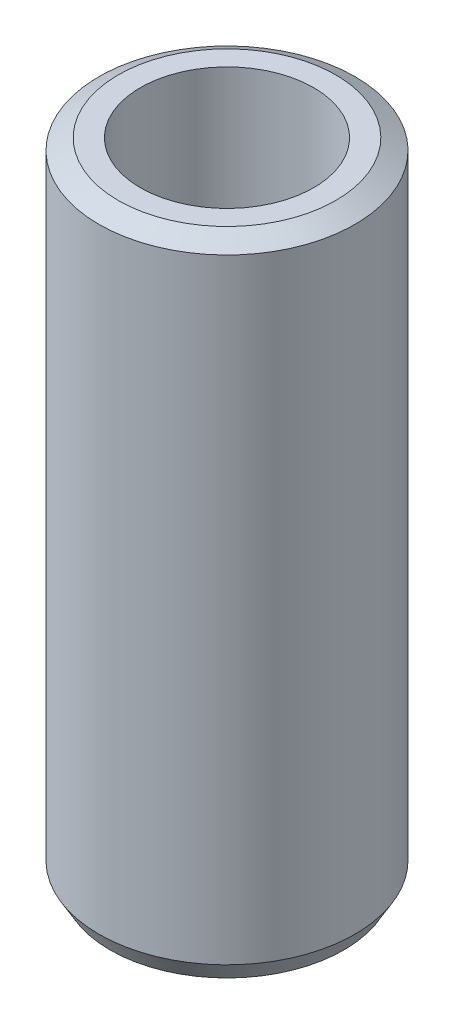
ISO-10303-21;
HEADER;
FILE_DESCRIPTION(('STEP AP214'),'2;1');
FILE_NAME('part.step','',(''),(''),'','','');
FILE_SCHEMA(('AUTOMOTIVE_DESIGN { 1 0 10303 214 1 1 1 1 }'));
ENDSEC;
DATA;
#1=APPLICATION_CONTEXT('core data for automotive mechanical design processes');
#2=APPLICATION_PROTOCOL_DEFINITION('international standard','automotive_design',2000,#1);
#3=PRODUCT_CONTEXT('',#1,'mechanical');
#4=PRODUCT('Part','Part','',(#3));
#5=PRODUCT_RELATED_PRODUCT_CATEGORY('part','',(#4));
#6=PRODUCT_DEFINITION_FORMATION('','',#4);
#7=PRODUCT_DEFINITION_CONTEXT('part definition',#1,'design');
#8=PRODUCT_DEFINITION('design','',#6,#7);
#9=PRODUCT_DEFINITION_SHAPE('','',#8);
#10=(LENGTH_UNIT() NAMED_UNIT(*) SI_UNIT(.MILLI.,.METRE.));
#11=(NAMED_UNIT(*) PLANE_ANGLE_UNIT() SI_UNIT($,.RADIAN.));
#12=(NAMED_UNIT(*) SI_UNIT($,.STERADIAN.) SOLID_ANGLE_UNIT());
#13=UNCERTAINTY_MEASURE_WITH_UNIT(LENGTH_MEASURE(1.E-05),#10,'distance_accuracy_value','');
#14=(GEOMETRIC_REPRESENTATION_CONTEXT(3) GLOBAL_UNCERTAINTY_ASSIGNED_CONTEXT((#13)) GLOBAL_UNIT_ASSIGNED_CONTEXT((#10,
#11,#12)) REPRESENTATION_CONTEXT('',''));
#15=CARTESIAN_POINT('',(0.,0.,0.));
#16=DIRECTION('',(0.,0.,1.));
#17=DIRECTION('',(1.,0.,0.));
#18=AXIS2_PLACEMENT_3D('',#15,#16,#17);
#19=CARTESIAN_POINT('',(0.,289.758508633857,0.));
#20=DIRECTION('',(0.,-1.,0.));
#21=DIRECTION('',(0.,0.,-1.));
#22=AXIS2_PLACEMENT_3D('',#19,#20,#21);
#23=CYLINDRICAL_SURFACE('',#22,57.5);
#24=CARTESIAN_POINT('',(0.,284.77323288239,0.));
#25=DIRECTION('',(0.,1.,0.));
#26=DIRECTION('',(0.,0.,1.));
#27=AXIS2_PLACEMENT_3D('',#24,#25,#26);
#28=CIRCLE('',#27,57.5);
#29=CARTESIAN_POINT('',(0.,284.77323288239,57.5));
#30=VERTEX_POINT('',#29);
#31=EDGE_CURVE('E50',#30,#30,#28,.F.);
#32=ORIENTED_EDGE('',*,*,#31,.T.);
#33=EDGE_LOOP('',(#32));
#34=FACE_BOUND('',#33,.T.);
#35=CARTESIAN_POINT('',(0.,8.63475089128318,0.));
#36=DIRECTION('',(0.,1.,0.));
#37=DIRECTION('',(0.,0.,1.));
#38=AXIS2_PLACEMENT_3D('',#35,#36,#37);
#39=CIRCLE('',#38,57.5);
#40=CARTESIAN_POINT('',(0.,8.63475089128318,57.5));
#41=VERTEX_POINT('',#40);
#42=EDGE_CURVE('E51',#41,#41,#39,.T.);
#43=ORIENTED_EDGE('',*,*,#42,.T.);
#44=EDGE_LOOP('',(#43));
#45=FACE_BOUND('',#44,.T.);
#46=ADVANCED_FACE('F39',(#34,#45),#23,.T.);
#47=CARTESIAN_POINT('',(0.,289.758508633857,0.));
#48=DIRECTION('',(0.,1.,0.));
#49=DIRECTION('',(0.,0.,1.));
#50=AXIS2_PLACEMENT_3D('',#47,#48,#49);
#51=PLANE('',#50);
#52=CARTESIAN_POINT('',(0.,289.758508633857,0.));
#53=DIRECTION('',(0.,1.,0.));
#54=DIRECTION('',(0.,0.,1.));
#55=AXIS2_PLACEMENT_3D('',#52,#53,#54);
#56=CIRCLE('',#55,48.8652491087168);
#57=CARTESIAN_POINT('',(0.,289.758508633857,48.8652491087168));
#58=VERTEX_POINT('',#57);
#59=EDGE_CURVE('E54',#58,#58,#56,.T.);
#60=ORIENTED_EDGE('',*,*,#59,.T.);
#61=EDGE_LOOP('',(#60));
#62=FACE_BOUND('',#61,.T.);
#63=CARTESIAN_POINT('',(0.,289.758508633857,0.));
#64=DIRECTION('',(0.,1.,0.));
#65=DIRECTION('',(0.,0.,1.));
#66=AXIS2_PLACEMENT_3D('',#63,#64,#65);
#67=CIRCLE('',#66,38.9490511219755);
#68=CARTESIAN_POINT('',(0.,289.758508633857,38.9490511219755));
#69=VERTEX_POINT('',#68);
#70=EDGE_CURVE('E58',#69,#69,#67,.T.);
#71=ORIENTED_EDGE('',*,*,#70,.F.);
#72=EDGE_LOOP('',(#71));
#73=FACE_BOUND('',#72,.T.);
#74=ADVANCED_FACE('F69',(#62,#73),#51,.T.);
#75=CARTESIAN_POINT('',(0.,0.,0.));
#76=DIRECTION('',(0.,1.,0.));
#77=DIRECTION('',(0.,0.,1.));
#78=AXIS2_PLACEMENT_3D('',#75,#76,#77);
#79=PLANE('',#78);
#80=CARTESIAN_POINT('',(0.,0.,0.));
#81=DIRECTION('',(0.,1.,0.));
#82=DIRECTION('',(0.,0.,1.));
#83=AXIS2_PLACEMENT_3D('',#80,#81,#82);
#84=CIRCLE('',#83,52.5147242485322);
#85=CARTESIAN_POINT('',(0.,0.,52.5147242485322));
#86=VERTEX_POINT('',#85);
#87=EDGE_CURVE('E10',#86,#86,#84,.F.);
#88=ORIENTED_EDGE('',*,*,#87,.T.);
#89=EDGE_LOOP('',(#88));
#90=FACE_BOUND('',#89,.T.);
#91=CARTESIAN_POINT('',(0.,0.,0.));
#92=DIRECTION('',(0.,1.,0.));
#93=DIRECTION('',(0.,0.,1.));
#94=AXIS2_PLACEMENT_3D('',#91,#92,#93);
#95=CIRCLE('',#94,38.9490511219755);
#96=CARTESIAN_POINT('',(0.,0.,38.9490511219755));
#97=VERTEX_POINT('',#96);
#98=EDGE_CURVE('E63',#97,#97,#95,.T.);
#99=ORIENTED_EDGE('',*,*,#98,.T.);
#100=EDGE_LOOP('',(#99));
#101=FACE_BOUND('',#100,.T.);
#102=ADVANCED_FACE('F75',(#90,#101),#79,.F.);
#103=CARTESIAN_POINT('',(0.,289.758508633857,0.));
#104=DIRECTION('',(0.,-1.,0.));
#105=DIRECTION('',(0.,0.,-1.));
#106=AXIS2_PLACEMENT_3D('',#103,#104,#105);
#107=CYLINDRICAL_SURFACE('',#106,38.9490511219755);
#108=ORIENTED_EDGE('',*,*,#70,.T.);
#109=EDGE_LOOP('',(#108));
#110=FACE_BOUND('',#109,.T.);
#111=ORIENTED_EDGE('',*,*,#98,.F.);
#112=EDGE_LOOP('',(#111));
#113=FACE_BOUND('',#112,.T.);
#114=ADVANCED_FACE('F70',(#110,#113),#107,.F.);
#115=CARTESIAN_POINT('',(0.,289.758508633857,0.));
#116=DIRECTION('',(0.,-1.,0.));
#117=DIRECTION('',(0.,0.,-1.));
#118=AXIS2_PLACEMENT_3D('',#115,#116,#117);
#119=CONICAL_SURFACE('',#118,48.8652491087168,1.04719755119659);
#120=ORIENTED_EDGE('',*,*,#31,.F.);
#121=EDGE_LOOP('',(#120));
#122=FACE_BOUND('',#121,.T.);
#123=ORIENTED_EDGE('',*,*,#59,.F.);
#124=EDGE_LOOP('',(#123));
#125=FACE_BOUND('',#124,.T.);
#126=ADVANCED_FACE('F81',(#122,#125),#119,.T.);
#127=CARTESIAN_POINT('',(0.,8.63475089128318,0.));
#128=DIRECTION('',(0.,1.,0.));
#129=DIRECTION('',(0.,0.,1.));
#130=AXIS2_PLACEMENT_3D('',#127,#128,#129);
#131=CONICAL_SURFACE('',#130,57.5,0.523598775598303);
#132=ORIENTED_EDGE('',*,*,#87,.F.);
#133=EDGE_LOOP('',(#132));
#134=FACE_BOUND('',#133,.T.);
#135=ORIENTED_EDGE('',*,*,#42,.F.);
#136=EDGE_LOOP('',(#135));
#137=FACE_BOUND('',#136,.T.);
#138=ADVANCED_FACE('F45',(#134,#137),#131,.T.);
#139=CLOSED_SHELL('',(#46,#74,#102,#114,#126,#138));
#140=MANIFOLD_SOLID_BREP('B2',#139);
#141=ADVANCED_BREP_SHAPE_REPRESENTATION('',(#18,#140),#14);
#142=SHAPE_DEFINITION_REPRESENTATION(#9,#141);
ENDSEC;
END-ISO-10303-21;
